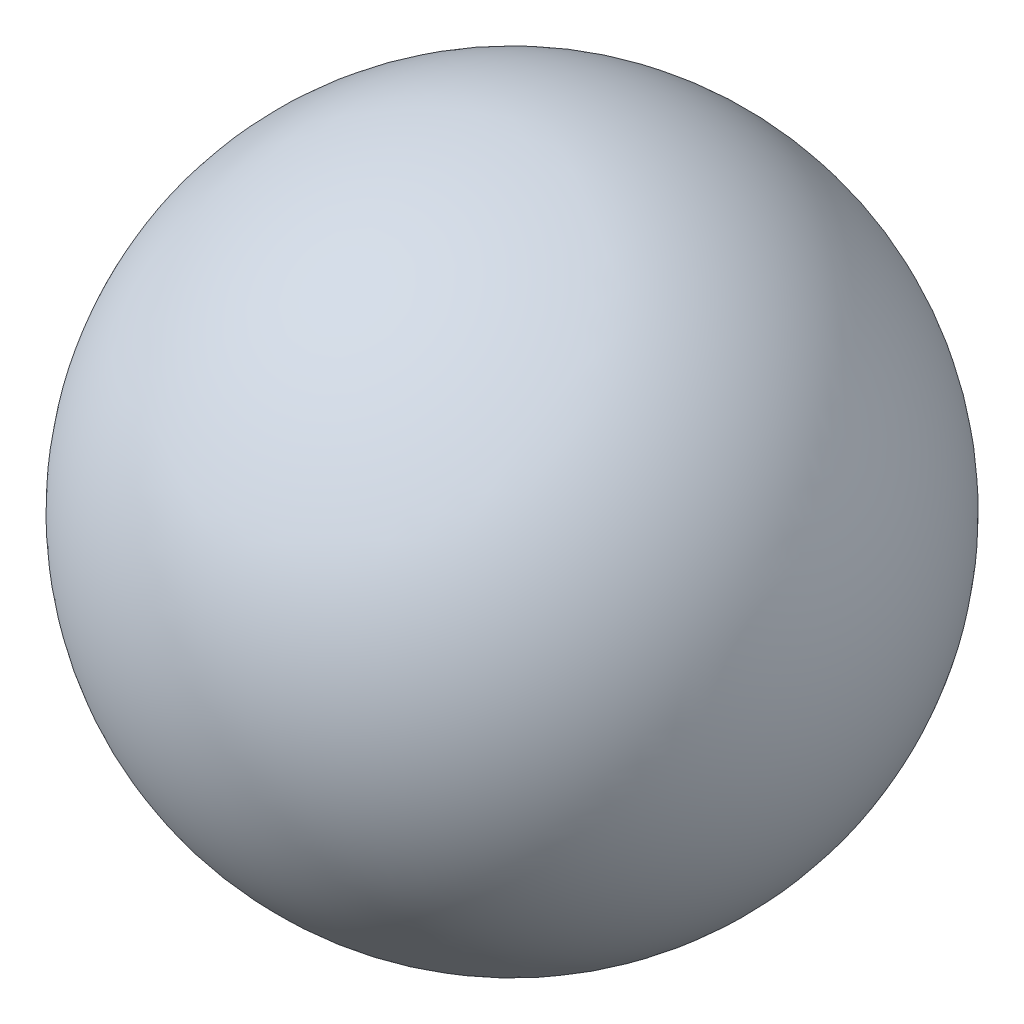
ISO-10303-21;
HEADER;
FILE_DESCRIPTION(('STEP AP214'),'2;1');
FILE_NAME('part.step','',(''),(''),'','','');
FILE_SCHEMA(('AUTOMOTIVE_DESIGN { 1 0 10303 214 1 1 1 1 }'));
ENDSEC;
DATA;
#1=APPLICATION_CONTEXT('core data for automotive mechanical design processes');
#2=APPLICATION_PROTOCOL_DEFINITION('international standard','automotive_design',2000,#1);
#3=PRODUCT_CONTEXT('',#1,'mechanical');
#4=PRODUCT('Part','Part','',(#3));
#5=PRODUCT_RELATED_PRODUCT_CATEGORY('part','',(#4));
#6=PRODUCT_DEFINITION_FORMATION('','',#4);
#7=PRODUCT_DEFINITION_CONTEXT('part definition',#1,'design');
#8=PRODUCT_DEFINITION('design','',#6,#7);
#9=PRODUCT_DEFINITION_SHAPE('','',#8);
#10=(LENGTH_UNIT() NAMED_UNIT(*) SI_UNIT(.MILLI.,.METRE.));
#11=(NAMED_UNIT(*) PLANE_ANGLE_UNIT() SI_UNIT($,.RADIAN.));
#12=(NAMED_UNIT(*) SI_UNIT($,.STERADIAN.) SOLID_ANGLE_UNIT());
#13=UNCERTAINTY_MEASURE_WITH_UNIT(LENGTH_MEASURE(1.E-05),#10,'distance_accuracy_value','');
#14=(GEOMETRIC_REPRESENTATION_CONTEXT(3) GLOBAL_UNCERTAINTY_ASSIGNED_CONTEXT((#13)) GLOBAL_UNIT_ASSIGNED_CONTEXT((#10,
#11,#12)) REPRESENTATION_CONTEXT('',''));
#15=CARTESIAN_POINT('',(0.,0.,0.));
#16=DIRECTION('',(0.,0.,1.));
#17=DIRECTION('',(1.,0.,0.));
#18=AXIS2_PLACEMENT_3D('',#15,#16,#17);
#19=CARTESIAN_POINT('',(0.,0.,0.));
#20=DIRECTION('',(1.,0.,0.));
#21=DIRECTION('',(0.,-1.,0.));
#22=AXIS2_PLACEMENT_3D('',#19,#20,#21);
#23=SPHERICAL_SURFACE('',#22,25.);
#24=CARTESIAN_POINT('',(25.,0.,0.));
#25=VERTEX_POINT('',#24);
#26=VERTEX_LOOP('',#25);
#27=FACE_BOUND('',#26,.T.);
#28=ADVANCED_FACE('F33',(#27),#23,.T.);
#29=CLOSED_SHELL('',(#28));
#30=MANIFOLD_SOLID_BREP('B2',#29);
#31=ADVANCED_BREP_SHAPE_REPRESENTATION('',(#18,#30),#14);
#32=SHAPE_DEFINITION_REPRESENTATION(#9,#31);
ENDSEC;
END-ISO-10303-21;
